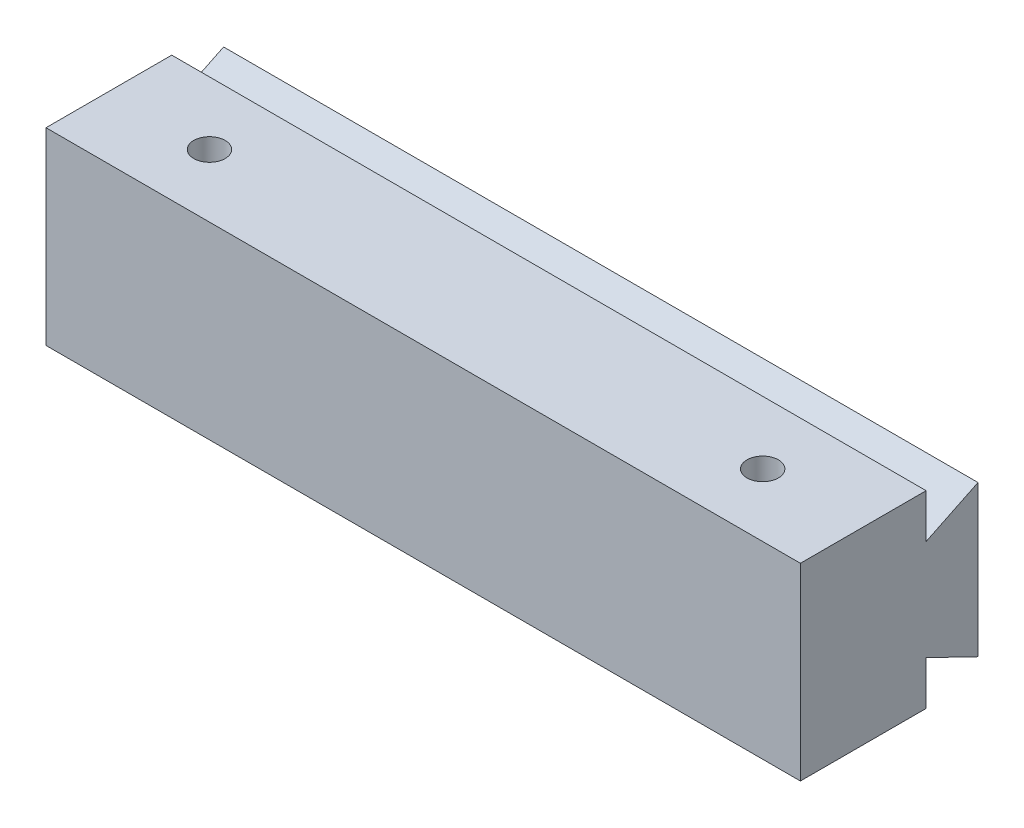
ISO-10303-21;
HEADER;
FILE_DESCRIPTION(('STEP AP214'),'2;1');
FILE_NAME('part.step','',(''),(''),'','','');
FILE_SCHEMA(('AUTOMOTIVE_DESIGN { 1 0 10303 214 1 1 1 1 }'));
ENDSEC;
DATA;
#1=APPLICATION_CONTEXT('core data for automotive mechanical design processes');
#2=APPLICATION_PROTOCOL_DEFINITION('international standard','automotive_design',2000,#1);
#3=PRODUCT_CONTEXT('',#1,'mechanical');
#4=PRODUCT('Part','Part','',(#3));
#5=PRODUCT_RELATED_PRODUCT_CATEGORY('part','',(#4));
#6=PRODUCT_DEFINITION_FORMATION('','',#4);
#7=PRODUCT_DEFINITION_CONTEXT('part definition',#1,'design');
#8=PRODUCT_DEFINITION('design','',#6,#7);
#9=PRODUCT_DEFINITION_SHAPE('','',#8);
#10=(LENGTH_UNIT() NAMED_UNIT(*) SI_UNIT(.MILLI.,.METRE.));
#11=(NAMED_UNIT(*) PLANE_ANGLE_UNIT() SI_UNIT($,.RADIAN.));
#12=(NAMED_UNIT(*) SI_UNIT($,.STERADIAN.) SOLID_ANGLE_UNIT());
#13=UNCERTAINTY_MEASURE_WITH_UNIT(LENGTH_MEASURE(1.E-05),#10,'distance_accuracy_value','');
#14=(GEOMETRIC_REPRESENTATION_CONTEXT(3) GLOBAL_UNCERTAINTY_ASSIGNED_CONTEXT((#13)) GLOBAL_UNIT_ASSIGNED_CONTEXT((#10,
#11,#12)) REPRESENTATION_CONTEXT('',''));
#15=CARTESIAN_POINT('',(0.,0.,0.));
#16=DIRECTION('',(0.,0.,1.));
#17=DIRECTION('',(1.,0.,0.));
#18=AXIS2_PLACEMENT_3D('',#15,#16,#17);
#19=CARTESIAN_POINT('',(0.,0.,0.));
#20=DIRECTION('',(0.,0.,-1.));
#21=DIRECTION('',(-1.,0.,0.));
#22=AXIS2_PLACEMENT_3D('',#19,#20,#21);
#23=PLANE('',#22);
#24=DIRECTION('',(0.,-1.,0.));
#25=VECTOR('',#24,1.);
#26=CARTESIAN_POINT('',(-30.,-7.5,0.));
#27=LINE('',#26,#25);
#28=CARTESIAN_POINT('',(-30.,-4.,0.));
#29=VERTEX_POINT('',#28);
#30=CARTESIAN_POINT('',(-30.,-7.5,0.));
#31=VERTEX_POINT('',#30);
#32=EDGE_CURVE('E55',#29,#31,#27,.T.);
#33=ORIENTED_EDGE('',*,*,#32,.F.);
#34=DIRECTION('',(1.,0.,0.));
#35=VECTOR('',#34,1.);
#36=CARTESIAN_POINT('',(-42.6891347016606,-4.,0.));
#37=LINE('',#36,#35);
#38=CARTESIAN_POINT('',(30.,-4.,0.));
#39=VERTEX_POINT('',#38);
#40=EDGE_CURVE('E118',#29,#39,#37,.T.);
#41=ORIENTED_EDGE('',*,*,#40,.T.);
#42=DIRECTION('',(0.,1.,0.));
#43=VECTOR('',#42,1.);
#44=CARTESIAN_POINT('',(30.,-7.5,0.));
#45=LINE('',#44,#43);
#46=CARTESIAN_POINT('',(30.,-7.5,0.));
#47=VERTEX_POINT('',#46);
#48=EDGE_CURVE('E133',#47,#39,#45,.T.);
#49=ORIENTED_EDGE('',*,*,#48,.F.);
#50=DIRECTION('',(1.,0.,0.));
#51=VECTOR('',#50,1.);
#52=CARTESIAN_POINT('',(-30.,-7.5,0.));
#53=LINE('',#52,#51);
#54=EDGE_CURVE('E162',#31,#47,#53,.T.);
#55=ORIENTED_EDGE('',*,*,#54,.F.);
#56=EDGE_LOOP('',(#33,#41,#49,#55));
#57=FACE_BOUND('',#56,.T.);
#58=ADVANCED_FACE('F39',(#57),#23,.T.);
#59=CARTESIAN_POINT('',(30.,-7.5,10.));
#60=DIRECTION('',(-1.,0.,0.));
#61=DIRECTION('',(0.,0.,1.));
#62=AXIS2_PLACEMENT_3D('',#59,#60,#61);
#63=PLANE('',#62);
#64=ORIENTED_EDGE('',*,*,#48,.T.);
#65=DIRECTION('',(0.,-0.436288926682653,-0.899806630590206));
#66=VECTOR('',#65,1.);
#67=CARTESIAN_POINT('',(30.,-6.,-4.12481993266221));
#68=LINE('',#67,#66);
#69=CARTESIAN_POINT('',(30.,-6.,-4.12481993266221));
#70=VERTEX_POINT('',#69);
#71=EDGE_CURVE('E112',#39,#70,#68,.T.);
#72=ORIENTED_EDGE('',*,*,#71,.T.);
#73=DIRECTION('',(0.,1.,0.));
#74=VECTOR('',#73,1.);
#75=CARTESIAN_POINT('',(30.,6.,-4.12481993266221));
#76=LINE('',#75,#74);
#77=CARTESIAN_POINT('',(30.,6.,-4.12481993266221));
#78=VERTEX_POINT('',#77);
#79=EDGE_CURVE('E121',#70,#78,#76,.T.);
#80=ORIENTED_EDGE('',*,*,#79,.T.);
#81=DIRECTION('',(0.,-0.436288926682653,0.899806630590205));
#82=VECTOR('',#81,1.);
#83=CARTESIAN_POINT('',(30.,4.,0.));
#84=LINE('',#83,#82);
#85=CARTESIAN_POINT('',(30.,4.,0.));
#86=VERTEX_POINT('',#85);
#87=EDGE_CURVE('E128',#78,#86,#84,.T.);
#88=ORIENTED_EDGE('',*,*,#87,.T.);
#89=CARTESIAN_POINT('',(30.,7.5,0.));
#90=VERTEX_POINT('',#89);
#91=EDGE_CURVE('E156',#86,#90,#45,.T.);
#92=ORIENTED_EDGE('',*,*,#91,.T.);
#93=DIRECTION('',(0.,0.,-1.));
#94=VECTOR('',#93,1.);
#95=CARTESIAN_POINT('',(30.,7.5,10.));
#96=LINE('',#95,#94);
#97=CARTESIAN_POINT('',(30.,7.5,10.));
#98=VERTEX_POINT('',#97);
#99=EDGE_CURVE('E11',#98,#90,#96,.T.);
#100=ORIENTED_EDGE('',*,*,#99,.F.);
#101=DIRECTION('',(0.,1.,0.));
#102=VECTOR('',#101,1.);
#103=CARTESIAN_POINT('',(30.,-7.5,10.));
#104=LINE('',#103,#102);
#105=CARTESIAN_POINT('',(30.,-7.5,10.));
#106=VERTEX_POINT('',#105);
#107=EDGE_CURVE('E157',#106,#98,#104,.T.);
#108=ORIENTED_EDGE('',*,*,#107,.F.);
#109=DIRECTION('',(0.,0.,-1.));
#110=VECTOR('',#109,1.);
#111=CARTESIAN_POINT('',(30.,-7.5,10.));
#112=LINE('',#111,#110);
#113=EDGE_CURVE('E171',#106,#47,#112,.T.);
#114=ORIENTED_EDGE('',*,*,#113,.T.);
#115=EDGE_LOOP('',(#64,#72,#80,#88,#92,#100,#108,#114));
#116=FACE_BOUND('',#115,.T.);
#117=ADVANCED_FACE('F41',(#116),#63,.F.);
#118=CARTESIAN_POINT('',(-30.,7.5,10.));
#119=DIRECTION('',(0.,-1.,0.));
#120=DIRECTION('',(0.,0.,-1.));
#121=AXIS2_PLACEMENT_3D('',#118,#119,#120);
#122=PLANE('',#121);
#123=CARTESIAN_POINT('',(-22.,7.5,5.));
#124=DIRECTION('',(0.,-1.,0.));
#125=DIRECTION('',(0.,0.,-1.));
#126=AXIS2_PLACEMENT_3D('',#123,#124,#125);
#127=CIRCLE('',#126,1.25);
#128=CARTESIAN_POINT('',(-22.,7.5,3.75));
#129=VERTEX_POINT('',#128);
#130=EDGE_CURVE('E135',#129,#129,#127,.T.);
#131=ORIENTED_EDGE('',*,*,#130,.T.);
#132=EDGE_LOOP('',(#131));
#133=FACE_BOUND('',#132,.T.);
#134=CARTESIAN_POINT('',(22.,7.5,5.));
#135=DIRECTION('',(0.,-1.,0.));
#136=DIRECTION('',(0.,0.,-1.));
#137=AXIS2_PLACEMENT_3D('',#134,#135,#136);
#138=CIRCLE('',#137,1.25);
#139=CARTESIAN_POINT('',(22.,7.5,3.75));
#140=VERTEX_POINT('',#139);
#141=EDGE_CURVE('E139',#140,#140,#138,.T.);
#142=ORIENTED_EDGE('',*,*,#141,.T.);
#143=EDGE_LOOP('',(#142));
#144=FACE_BOUND('',#143,.T.);
#145=DIRECTION('',(-1.,0.,0.));
#146=VECTOR('',#145,1.);
#147=CARTESIAN_POINT('',(-30.,7.5,0.));
#148=LINE('',#147,#146);
#149=CARTESIAN_POINT('',(-30.,7.5,0.));
#150=VERTEX_POINT('',#149);
#151=EDGE_CURVE('E174',#90,#150,#148,.T.);
#152=ORIENTED_EDGE('',*,*,#151,.T.);
#153=DIRECTION('',(0.,0.,-1.));
#154=VECTOR('',#153,1.);
#155=CARTESIAN_POINT('',(-30.,7.5,10.));
#156=LINE('',#155,#154);
#157=CARTESIAN_POINT('',(-30.,7.5,10.));
#158=VERTEX_POINT('',#157);
#159=EDGE_CURVE('E48',#158,#150,#156,.T.);
#160=ORIENTED_EDGE('',*,*,#159,.F.);
#161=DIRECTION('',(-1.,0.,0.));
#162=VECTOR('',#161,1.);
#163=CARTESIAN_POINT('',(-30.,7.5,10.));
#164=LINE('',#163,#162);
#165=EDGE_CURVE('E161',#98,#158,#164,.T.);
#166=ORIENTED_EDGE('',*,*,#165,.F.);
#167=ORIENTED_EDGE('',*,*,#99,.T.);
#168=EDGE_LOOP('',(#152,#160,#166,#167));
#169=FACE_BOUND('',#168,.T.);
#170=ADVANCED_FACE('F199',(#133,#144,#169),#122,.F.);
#171=CARTESIAN_POINT('',(-30.,-7.5,10.));
#172=DIRECTION('',(1.,0.,0.));
#173=DIRECTION('',(0.,0.,-1.));
#174=AXIS2_PLACEMENT_3D('',#171,#172,#173);
#175=PLANE('',#174);
#176=CARTESIAN_POINT('',(-30.,4.,0.));
#177=VERTEX_POINT('',#176);
#178=EDGE_CURVE('E177',#150,#177,#27,.T.);
#179=ORIENTED_EDGE('',*,*,#178,.T.);
#180=DIRECTION('',(0.,0.436288926682653,-0.899806630590205));
#181=VECTOR('',#180,1.);
#182=CARTESIAN_POINT('',(-30.,4.,0.));
#183=LINE('',#182,#181);
#184=CARTESIAN_POINT('',(-30.,6.,-4.12481993266221));
#185=VERTEX_POINT('',#184);
#186=EDGE_CURVE('E142',#177,#185,#183,.T.);
#187=ORIENTED_EDGE('',*,*,#186,.T.);
#188=DIRECTION('',(0.,-1.,0.));
#189=VECTOR('',#188,1.);
#190=CARTESIAN_POINT('',(-30.,6.,-4.12481993266221));
#191=LINE('',#190,#189);
#192=CARTESIAN_POINT('',(-30.,-6.,-4.12481993266221));
#193=VERTEX_POINT('',#192);
#194=EDGE_CURVE('E149',#185,#193,#191,.T.);
#195=ORIENTED_EDGE('',*,*,#194,.T.);
#196=DIRECTION('',(0.,0.436288926682653,0.899806630590206));
#197=VECTOR('',#196,1.);
#198=CARTESIAN_POINT('',(-30.,-6.,-4.12481993266221));
#199=LINE('',#198,#197);
#200=EDGE_CURVE('E113',#193,#29,#199,.T.);
#201=ORIENTED_EDGE('',*,*,#200,.T.);
#202=ORIENTED_EDGE('',*,*,#32,.T.);
#203=DIRECTION('',(0.,0.,-1.));
#204=VECTOR('',#203,1.);
#205=CARTESIAN_POINT('',(-30.,-7.5,10.));
#206=LINE('',#205,#204);
#207=CARTESIAN_POINT('',(-30.,-7.5,10.));
#208=VERTEX_POINT('',#207);
#209=EDGE_CURVE('E184',#208,#31,#206,.T.);
#210=ORIENTED_EDGE('',*,*,#209,.F.);
#211=DIRECTION('',(0.,-1.,0.));
#212=VECTOR('',#211,1.);
#213=CARTESIAN_POINT('',(-30.,-7.5,10.));
#214=LINE('',#213,#212);
#215=EDGE_CURVE('E165',#158,#208,#214,.T.);
#216=ORIENTED_EDGE('',*,*,#215,.F.);
#217=ORIENTED_EDGE('',*,*,#159,.T.);
#218=EDGE_LOOP('',(#179,#187,#195,#201,#202,#210,#216,#217));
#219=FACE_BOUND('',#218,.T.);
#220=ADVANCED_FACE('F192',(#219),#175,.F.);
#221=CARTESIAN_POINT('',(-30.,-7.5,10.));
#222=DIRECTION('',(0.,1.,0.));
#223=DIRECTION('',(0.,0.,1.));
#224=AXIS2_PLACEMENT_3D('',#221,#222,#223);
#225=PLANE('',#224);
#226=CARTESIAN_POINT('',(-22.,-7.5,5.));
#227=DIRECTION('',(0.,1.,0.));
#228=DIRECTION('',(0.,0.,1.));
#229=AXIS2_PLACEMENT_3D('',#226,#227,#228);
#230=CIRCLE('',#229,1.25);
#231=CARTESIAN_POINT('',(-22.,-7.5,6.25));
#232=VERTEX_POINT('',#231);
#233=EDGE_CURVE('E208',#232,#232,#230,.T.);
#234=ORIENTED_EDGE('',*,*,#233,.T.);
#235=EDGE_LOOP('',(#234));
#236=FACE_BOUND('',#235,.T.);
#237=CARTESIAN_POINT('',(22.,-7.5,5.));
#238=DIRECTION('',(0.,1.,0.));
#239=DIRECTION('',(0.,0.,1.));
#240=AXIS2_PLACEMENT_3D('',#237,#238,#239);
#241=CIRCLE('',#240,1.25);
#242=CARTESIAN_POINT('',(22.,-7.5,6.25));
#243=VERTEX_POINT('',#242);
#244=EDGE_CURVE('E209',#243,#243,#241,.T.);
#245=ORIENTED_EDGE('',*,*,#244,.T.);
#246=EDGE_LOOP('',(#245));
#247=FACE_BOUND('',#246,.T.);
#248=ORIENTED_EDGE('',*,*,#54,.T.);
#249=ORIENTED_EDGE('',*,*,#113,.F.);
#250=DIRECTION('',(1.,0.,0.));
#251=VECTOR('',#250,1.);
#252=CARTESIAN_POINT('',(-30.,-7.5,10.));
#253=LINE('',#252,#251);
#254=EDGE_CURVE('E168',#208,#106,#253,.T.);
#255=ORIENTED_EDGE('',*,*,#254,.F.);
#256=ORIENTED_EDGE('',*,*,#209,.T.);
#257=EDGE_LOOP('',(#248,#249,#255,#256));
#258=FACE_BOUND('',#257,.T.);
#259=ADVANCED_FACE('F217',(#236,#247,#258),#225,.F.);
#260=CARTESIAN_POINT('',(0.,0.,10.));
#261=DIRECTION('',(0.,0.,-1.));
#262=DIRECTION('',(-1.,0.,0.));
#263=AXIS2_PLACEMENT_3D('',#260,#261,#262);
#264=PLANE('',#263);
#265=ORIENTED_EDGE('',*,*,#107,.T.);
#266=ORIENTED_EDGE('',*,*,#165,.T.);
#267=ORIENTED_EDGE('',*,*,#215,.T.);
#268=ORIENTED_EDGE('',*,*,#254,.T.);
#269=EDGE_LOOP('',(#265,#266,#267,#268));
#270=FACE_BOUND('',#269,.T.);
#271=ADVANCED_FACE('F249',(#270),#264,.F.);
#272=DIRECTION('',(1.,0.,0.));
#273=VECTOR('',#272,1.);
#274=CARTESIAN_POINT('',(-42.6891347016606,4.,0.));
#275=LINE('',#274,#273);
#276=EDGE_CURVE('E63',#177,#86,#275,.T.);
#277=ORIENTED_EDGE('',*,*,#276,.F.);
#278=ORIENTED_EDGE('',*,*,#178,.F.);
#279=ORIENTED_EDGE('',*,*,#151,.F.);
#280=ORIENTED_EDGE('',*,*,#91,.F.);
#281=EDGE_LOOP('',(#277,#278,#279,#280));
#282=FACE_BOUND('',#281,.T.);
#283=ADVANCED_FACE('F197',(#282),#23,.T.);
#284=CARTESIAN_POINT('',(-42.6891347016606,4.,0.));
#285=DIRECTION('',(0.,0.899806630590205,0.436288926682653));
#286=DIRECTION('',(0.,-0.436288926682653,0.899806630590205));
#287=AXIS2_PLACEMENT_3D('',#284,#285,#286);
#288=PLANE('',#287);
#289=ORIENTED_EDGE('',*,*,#186,.F.);
#290=ORIENTED_EDGE('',*,*,#276,.T.);
#291=ORIENTED_EDGE('',*,*,#87,.F.);
#292=DIRECTION('',(1.,0.,0.));
#293=VECTOR('',#292,1.);
#294=CARTESIAN_POINT('',(-42.6891347016606,6.,-4.12481993266221));
#295=LINE('',#294,#293);
#296=EDGE_CURVE('E117',#185,#78,#295,.T.);
#297=ORIENTED_EDGE('',*,*,#296,.F.);
#298=EDGE_LOOP('',(#289,#290,#291,#297));
#299=FACE_BOUND('',#298,.T.);
#300=ADVANCED_FACE('F248',(#299),#288,.T.);
#301=CARTESIAN_POINT('',(-42.6891347016606,6.,-4.12481993266221));
#302=DIRECTION('',(0.,0.,-1.));
#303=DIRECTION('',(0.,1.,0.));
#304=AXIS2_PLACEMENT_3D('',#301,#302,#303);
#305=PLANE('',#304);
#306=ORIENTED_EDGE('',*,*,#194,.F.);
#307=ORIENTED_EDGE('',*,*,#296,.T.);
#308=ORIENTED_EDGE('',*,*,#79,.F.);
#309=DIRECTION('',(1.,0.,0.));
#310=VECTOR('',#309,1.);
#311=CARTESIAN_POINT('',(-42.6891347016606,-6.,-4.12481993266221));
#312=LINE('',#311,#310);
#313=EDGE_CURVE('E107',#193,#70,#312,.T.);
#314=ORIENTED_EDGE('',*,*,#313,.F.);
#315=EDGE_LOOP('',(#306,#307,#308,#314));
#316=FACE_BOUND('',#315,.T.);
#317=ADVANCED_FACE('F122',(#316),#305,.T.);
#318=CARTESIAN_POINT('',(-42.6891347016606,-6.,-4.12481993266221));
#319=DIRECTION('',(0.,-0.899806630590205,0.436288926682653));
#320=DIRECTION('',(0.,-0.436288926682653,-0.899806630590206));
#321=AXIS2_PLACEMENT_3D('',#318,#319,#320);
#322=PLANE('',#321);
#323=ORIENTED_EDGE('',*,*,#200,.F.);
#324=ORIENTED_EDGE('',*,*,#313,.T.);
#325=ORIENTED_EDGE('',*,*,#71,.F.);
#326=ORIENTED_EDGE('',*,*,#40,.F.);
#327=EDGE_LOOP('',(#323,#324,#325,#326));
#328=FACE_BOUND('',#327,.T.);
#329=ADVANCED_FACE('F109',(#328),#322,.T.);
#330=CARTESIAN_POINT('',(22.,-7.5,5.));
#331=DIRECTION('',(0.,1.,0.));
#332=DIRECTION('',(0.,0.,1.));
#333=AXIS2_PLACEMENT_3D('',#330,#331,#332);
#334=CYLINDRICAL_SURFACE('',#333,1.25);
#335=ORIENTED_EDGE('',*,*,#244,.F.);
#336=EDGE_LOOP('',(#335));
#337=FACE_BOUND('',#336,.T.);
#338=ORIENTED_EDGE('',*,*,#141,.F.);
#339=EDGE_LOOP('',(#338));
#340=FACE_BOUND('',#339,.T.);
#341=ADVANCED_FACE('F223',(#337,#340),#334,.F.);
#342=CARTESIAN_POINT('',(-22.,-7.5,5.));
#343=DIRECTION('',(0.,1.,0.));
#344=DIRECTION('',(0.,0.,1.));
#345=AXIS2_PLACEMENT_3D('',#342,#343,#344);
#346=CYLINDRICAL_SURFACE('',#345,1.25);
#347=ORIENTED_EDGE('',*,*,#233,.F.);
#348=EDGE_LOOP('',(#347));
#349=FACE_BOUND('',#348,.T.);
#350=ORIENTED_EDGE('',*,*,#130,.F.);
#351=EDGE_LOOP('',(#350));
#352=FACE_BOUND('',#351,.T.);
#353=ADVANCED_FACE('F220',(#349,#352),#346,.F.);
#354=CLOSED_SHELL('',(#58,#117,#170,#220,#259,#271,#283,#300,#317,#329,#341,#353));
#355=MANIFOLD_SOLID_BREP('B2',#354);
#356=ADVANCED_BREP_SHAPE_REPRESENTATION('',(#18,#355),#14);
#357=SHAPE_DEFINITION_REPRESENTATION(#9,#356);
ENDSEC;
END-ISO-10303-21;
